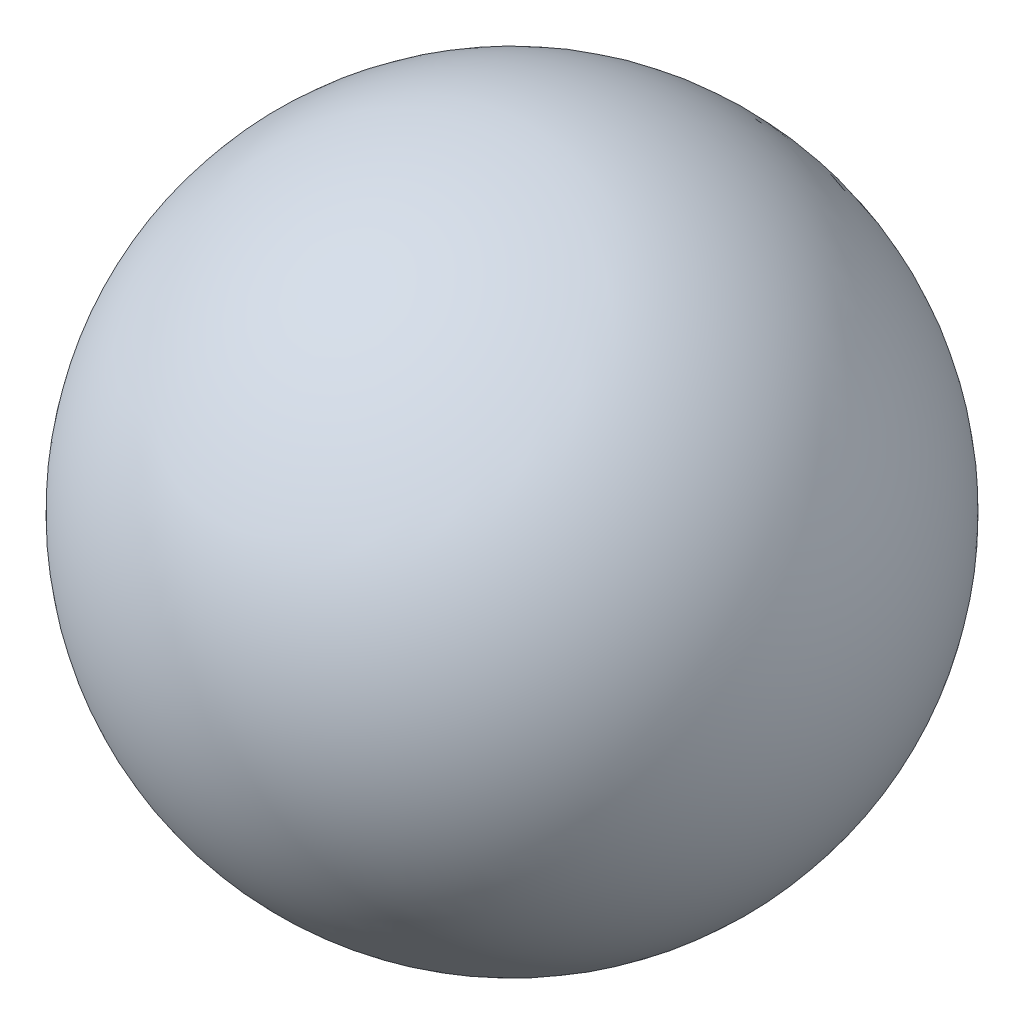
ISO-10303-21;
HEADER;
FILE_DESCRIPTION(('STEP AP214'),'2;1');
FILE_NAME('part.step','',(''),(''),'','','');
FILE_SCHEMA(('AUTOMOTIVE_DESIGN { 1 0 10303 214 1 1 1 1 }'));
ENDSEC;
DATA;
#1=APPLICATION_CONTEXT('core data for automotive mechanical design processes');
#2=APPLICATION_PROTOCOL_DEFINITION('international standard','automotive_design',2000,#1);
#3=PRODUCT_CONTEXT('',#1,'mechanical');
#4=PRODUCT('Part','Part','',(#3));
#5=PRODUCT_RELATED_PRODUCT_CATEGORY('part','',(#4));
#6=PRODUCT_DEFINITION_FORMATION('','',#4);
#7=PRODUCT_DEFINITION_CONTEXT('part definition',#1,'design');
#8=PRODUCT_DEFINITION('design','',#6,#7);
#9=PRODUCT_DEFINITION_SHAPE('','',#8);
#10=(LENGTH_UNIT() NAMED_UNIT(*) SI_UNIT(.MILLI.,.METRE.));
#11=(NAMED_UNIT(*) PLANE_ANGLE_UNIT() SI_UNIT($,.RADIAN.));
#12=(NAMED_UNIT(*) SI_UNIT($,.STERADIAN.) SOLID_ANGLE_UNIT());
#13=UNCERTAINTY_MEASURE_WITH_UNIT(LENGTH_MEASURE(1.E-05),#10,'distance_accuracy_value','');
#14=(GEOMETRIC_REPRESENTATION_CONTEXT(3) GLOBAL_UNCERTAINTY_ASSIGNED_CONTEXT((#13)) GLOBAL_UNIT_ASSIGNED_CONTEXT((#10,
#11,#12)) REPRESENTATION_CONTEXT('',''));
#15=CARTESIAN_POINT('',(0.,0.,0.));
#16=DIRECTION('',(0.,0.,1.));
#17=DIRECTION('',(1.,0.,0.));
#18=AXIS2_PLACEMENT_3D('',#15,#16,#17);
#19=CARTESIAN_POINT('',(67.76,-50.2666610361504,-47.7738269822165));
#20=DIRECTION('',(0.,-0.724851812050188,-0.68890481967218));
#21=DIRECTION('',(0.173648177666933,0.67843880750064,-0.713839684291973));
#22=AXIS2_PLACEMENT_3D('',#19,#20,#21);
#23=SPHERICAL_SURFACE('',#22,7.15);
#24=CARTESIAN_POINT('',(67.76,-45.0839705799916,-42.8481575215604));
#25=VERTEX_POINT('',#24);
#26=VERTEX_LOOP('',#25);
#27=FACE_BOUND('',#26,.T.);
#28=CARTESIAN_POINT('',(67.76,-55.4493514923092,-52.6994964428726));
#29=VERTEX_POINT('',#28);
#30=VERTEX_LOOP('',#29);
#31=FACE_BOUND('',#30,.T.);
#32=ADVANCED_FACE('F16',(#27,#31),#23,.T.);
#33=CLOSED_SHELL('',(#32));
#34=MANIFOLD_SOLID_BREP('B1',#33);
#35=ADVANCED_BREP_SHAPE_REPRESENTATION('',(#18,#34),#14);
#36=SHAPE_DEFINITION_REPRESENTATION(#9,#35);
ENDSEC;
END-ISO-10303-21;
